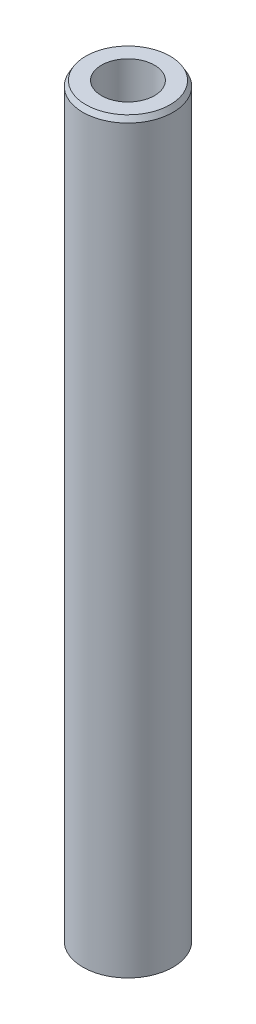
ISO-10303-21;
HEADER;
FILE_DESCRIPTION(('STEP AP214'),'2;1');
FILE_NAME('part.step','',(''),(''),'','','');
FILE_SCHEMA(('AUTOMOTIVE_DESIGN { 1 0 10303 214 1 1 1 1 }'));
ENDSEC;
DATA;
#1=APPLICATION_CONTEXT('core data for automotive mechanical design processes');
#2=APPLICATION_PROTOCOL_DEFINITION('international standard','automotive_design',2000,#1);
#3=PRODUCT_CONTEXT('',#1,'mechanical');
#4=PRODUCT('Part','Part','',(#3));
#5=PRODUCT_RELATED_PRODUCT_CATEGORY('part','',(#4));
#6=PRODUCT_DEFINITION_FORMATION('','',#4);
#7=PRODUCT_DEFINITION_CONTEXT('part definition',#1,'design');
#8=PRODUCT_DEFINITION('design','',#6,#7);
#9=PRODUCT_DEFINITION_SHAPE('','',#8);
#10=(LENGTH_UNIT() NAMED_UNIT(*) SI_UNIT(.MILLI.,.METRE.));
#11=(NAMED_UNIT(*) PLANE_ANGLE_UNIT() SI_UNIT($,.RADIAN.));
#12=(NAMED_UNIT(*) SI_UNIT($,.STERADIAN.) SOLID_ANGLE_UNIT());
#13=UNCERTAINTY_MEASURE_WITH_UNIT(LENGTH_MEASURE(1.E-05),#10,'distance_accuracy_value','');
#14=(GEOMETRIC_REPRESENTATION_CONTEXT(3) GLOBAL_UNCERTAINTY_ASSIGNED_CONTEXT((#13)) GLOBAL_UNIT_ASSIGNED_CONTEXT((#10,
#11,#12)) REPRESENTATION_CONTEXT('',''));
#15=CARTESIAN_POINT('',(0.,0.,0.));
#16=DIRECTION('',(0.,0.,1.));
#17=DIRECTION('',(1.,0.,0.));
#18=AXIS2_PLACEMENT_3D('',#15,#16,#17);
#19=CARTESIAN_POINT('',(0.,580.890931568767,0.));
#20=DIRECTION('',(0.,-1.,0.));
#21=DIRECTION('',(0.,0.,-1.));
#22=AXIS2_PLACEMENT_3D('',#19,#20,#21);
#23=CYLINDRICAL_SURFACE('',#22,35.);
#24=CARTESIAN_POINT('',(0.,576.926167367294,0.));
#25=DIRECTION('',(0.,1.,0.));
#26=DIRECTION('',(0.,0.,1.));
#27=AXIS2_PLACEMENT_3D('',#24,#25,#26);
#28=CIRCLE('',#27,35.);
#29=CARTESIAN_POINT('',(0.,576.926167367294,35.));
#30=VERTEX_POINT('',#29);
#31=EDGE_CURVE('E50',#30,#30,#28,.F.);
#32=ORIENTED_EDGE('',*,*,#31,.T.);
#33=EDGE_LOOP('',(#32));
#34=FACE_BOUND('',#33,.T.);
#35=CARTESIAN_POINT('',(0.,2.28905767899346,0.));
#36=DIRECTION('',(0.,1.,0.));
#37=DIRECTION('',(0.,0.,1.));
#38=AXIS2_PLACEMENT_3D('',#35,#36,#37);
#39=CIRCLE('',#38,35.);
#40=CARTESIAN_POINT('',(0.,2.28905767899346,35.));
#41=VERTEX_POINT('',#40);
#42=EDGE_CURVE('E51',#41,#41,#39,.T.);
#43=ORIENTED_EDGE('',*,*,#42,.T.);
#44=EDGE_LOOP('',(#43));
#45=FACE_BOUND('',#44,.T.);
#46=ADVANCED_FACE('F39',(#34,#45),#23,.T.);
#47=CARTESIAN_POINT('',(0.,580.890931568767,0.));
#48=DIRECTION('',(0.,1.,0.));
#49=DIRECTION('',(0.,0.,1.));
#50=AXIS2_PLACEMENT_3D('',#47,#48,#49);
#51=PLANE('',#50);
#52=CARTESIAN_POINT('',(0.,580.890931568767,0.));
#53=DIRECTION('',(0.,1.,0.));
#54=DIRECTION('',(0.,0.,1.));
#55=AXIS2_PLACEMENT_3D('',#52,#53,#54);
#56=CIRCLE('',#55,32.7109423210065);
#57=CARTESIAN_POINT('',(0.,580.890931568767,32.7109423210065));
#58=VERTEX_POINT('',#57);
#59=EDGE_CURVE('E54',#58,#58,#56,.T.);
#60=ORIENTED_EDGE('',*,*,#59,.T.);
#61=EDGE_LOOP('',(#60));
#62=FACE_BOUND('',#61,.T.);
#63=CARTESIAN_POINT('',(0.,580.890931568767,0.));
#64=DIRECTION('',(0.,1.,0.));
#65=DIRECTION('',(0.,0.,1.));
#66=AXIS2_PLACEMENT_3D('',#63,#64,#65);
#67=CIRCLE('',#66,20.5550027832891);
#68=CARTESIAN_POINT('',(0.,580.890931568767,20.5550027832891));
#69=VERTEX_POINT('',#68);
#70=EDGE_CURVE('E58',#69,#69,#67,.T.);
#71=ORIENTED_EDGE('',*,*,#70,.F.);
#72=EDGE_LOOP('',(#71));
#73=FACE_BOUND('',#72,.T.);
#74=ADVANCED_FACE('F69',(#62,#73),#51,.T.);
#75=CARTESIAN_POINT('',(0.,0.,0.));
#76=DIRECTION('',(0.,1.,0.));
#77=DIRECTION('',(0.,0.,1.));
#78=AXIS2_PLACEMENT_3D('',#75,#76,#77);
#79=PLANE('',#78);
#80=CARTESIAN_POINT('',(0.,0.,0.));
#81=DIRECTION('',(0.,1.,0.));
#82=DIRECTION('',(0.,0.,1.));
#83=AXIS2_PLACEMENT_3D('',#80,#81,#82);
#84=CIRCLE('',#83,31.0352357985277);
#85=CARTESIAN_POINT('',(0.,0.,31.0352357985277));
#86=VERTEX_POINT('',#85);
#87=EDGE_CURVE('E10',#86,#86,#84,.F.);
#88=ORIENTED_EDGE('',*,*,#87,.T.);
#89=EDGE_LOOP('',(#88));
#90=FACE_BOUND('',#89,.T.);
#91=CARTESIAN_POINT('',(0.,0.,0.));
#92=DIRECTION('',(0.,1.,0.));
#93=DIRECTION('',(0.,0.,1.));
#94=AXIS2_PLACEMENT_3D('',#91,#92,#93);
#95=CIRCLE('',#94,20.5550027832891);
#96=CARTESIAN_POINT('',(0.,0.,20.5550027832891));
#97=VERTEX_POINT('',#96);
#98=EDGE_CURVE('E63',#97,#97,#95,.T.);
#99=ORIENTED_EDGE('',*,*,#98,.T.);
#100=EDGE_LOOP('',(#99));
#101=FACE_BOUND('',#100,.T.);
#102=ADVANCED_FACE('F75',(#90,#101),#79,.F.);
#103=CARTESIAN_POINT('',(0.,580.890931568767,0.));
#104=DIRECTION('',(0.,-1.,0.));
#105=DIRECTION('',(0.,0.,-1.));
#106=AXIS2_PLACEMENT_3D('',#103,#104,#105);
#107=CYLINDRICAL_SURFACE('',#106,20.5550027832891);
#108=ORIENTED_EDGE('',*,*,#70,.T.);
#109=EDGE_LOOP('',(#108));
#110=FACE_BOUND('',#109,.T.);
#111=ORIENTED_EDGE('',*,*,#98,.F.);
#112=EDGE_LOOP('',(#111));
#113=FACE_BOUND('',#112,.T.);
#114=ADVANCED_FACE('F70',(#110,#113),#107,.F.);
#115=CARTESIAN_POINT('',(0.,580.890931568767,0.));
#116=DIRECTION('',(0.,-1.,0.));
#117=DIRECTION('',(0.,0.,-1.));
#118=AXIS2_PLACEMENT_3D('',#115,#116,#117);
#119=CONICAL_SURFACE('',#118,32.7109423210065,0.523598775598298);
#120=ORIENTED_EDGE('',*,*,#31,.F.);
#121=EDGE_LOOP('',(#120));
#122=FACE_BOUND('',#121,.T.);
#123=ORIENTED_EDGE('',*,*,#59,.F.);
#124=EDGE_LOOP('',(#123));
#125=FACE_BOUND('',#124,.T.);
#126=ADVANCED_FACE('F81',(#122,#125),#119,.T.);
#127=CARTESIAN_POINT('',(0.,2.28905767899346,0.));
#128=DIRECTION('',(0.,1.,0.));
#129=DIRECTION('',(0.,0.,1.));
#130=AXIS2_PLACEMENT_3D('',#127,#128,#129);
#131=CONICAL_SURFACE('',#130,35.,1.04719755119659);
#132=ORIENTED_EDGE('',*,*,#87,.F.);
#133=EDGE_LOOP('',(#132));
#134=FACE_BOUND('',#133,.T.);
#135=ORIENTED_EDGE('',*,*,#42,.F.);
#136=EDGE_LOOP('',(#135));
#137=FACE_BOUND('',#136,.T.);
#138=ADVANCED_FACE('F45',(#134,#137),#131,.T.);
#139=CLOSED_SHELL('',(#46,#74,#102,#114,#126,#138));
#140=MANIFOLD_SOLID_BREP('B2',#139);
#141=ADVANCED_BREP_SHAPE_REPRESENTATION('',(#18,#140),#14);
#142=SHAPE_DEFINITION_REPRESENTATION(#9,#141);
ENDSEC;
END-ISO-10303-21;
